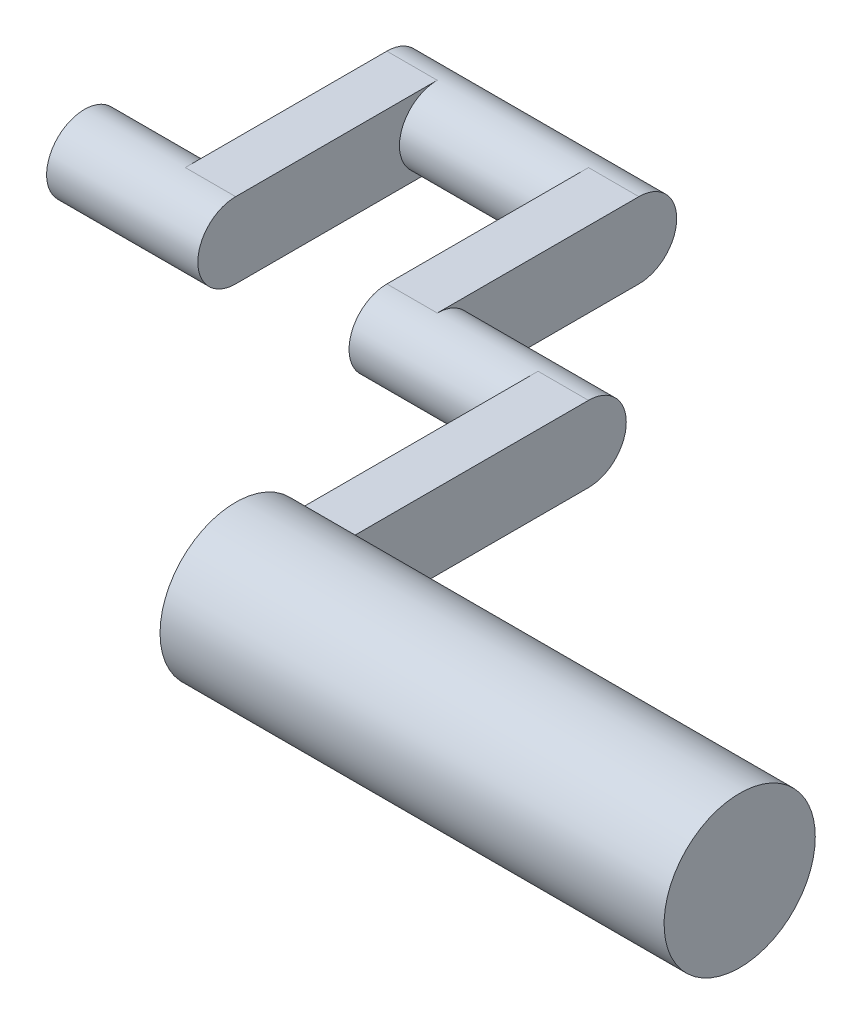
ISO-10303-21;
HEADER;
FILE_DESCRIPTION(('STEP AP214'),'2;1');
FILE_NAME('part.step','',(''),(''),'','','');
FILE_SCHEMA(('AUTOMOTIVE_DESIGN { 1 0 10303 214 1 1 1 1 }'));
ENDSEC;
DATA;
#1=APPLICATION_CONTEXT('core data for automotive mechanical design processes');
#2=APPLICATION_PROTOCOL_DEFINITION('international standard','automotive_design',2000,#1);
#3=PRODUCT_CONTEXT('',#1,'mechanical');
#4=PRODUCT('Part','Part','',(#3));
#5=PRODUCT_RELATED_PRODUCT_CATEGORY('part','',(#4));
#6=PRODUCT_DEFINITION_FORMATION('','',#4);
#7=PRODUCT_DEFINITION_CONTEXT('part definition',#1,'design');
#8=PRODUCT_DEFINITION('design','',#6,#7);
#9=PRODUCT_DEFINITION_SHAPE('','',#8);
#10=(LENGTH_UNIT() NAMED_UNIT(*) SI_UNIT(.MILLI.,.METRE.));
#11=(NAMED_UNIT(*) PLANE_ANGLE_UNIT() SI_UNIT($,.RADIAN.));
#12=(NAMED_UNIT(*) SI_UNIT($,.STERADIAN.) SOLID_ANGLE_UNIT());
#13=UNCERTAINTY_MEASURE_WITH_UNIT(LENGTH_MEASURE(1.E-05),#10,'distance_accuracy_value','');
#14=(GEOMETRIC_REPRESENTATION_CONTEXT(3) GLOBAL_UNCERTAINTY_ASSIGNED_CONTEXT((#13)) GLOBAL_UNIT_ASSIGNED_CONTEXT((#10,
#11,#12)) REPRESENTATION_CONTEXT('',''));
#15=CARTESIAN_POINT('',(0.,0.,0.));
#16=DIRECTION('',(0.,0.,1.));
#17=DIRECTION('',(1.,0.,0.));
#18=AXIS2_PLACEMENT_3D('',#15,#16,#17);
#19=CARTESIAN_POINT('',(-38.1,0.,-76.2));
#20=DIRECTION('',(1.,0.,0.));
#21=DIRECTION('',(0.,0.,-1.));
#22=AXIS2_PLACEMENT_3D('',#19,#20,#21);
#23=CYLINDRICAL_SURFACE('',#22,9.52500000000001);
#24=CARTESIAN_POINT('',(0.,0.,-76.2));
#25=DIRECTION('',(1.,0.,0.));
#26=DIRECTION('',(0.,0.,-1.));
#27=AXIS2_PLACEMENT_3D('',#24,#25,#26);
#28=CIRCLE('',#27,9.52500000000001);
#29=CARTESIAN_POINT('',(0.,9.52500000000001,-76.2));
#30=VERTEX_POINT('',#29);
#31=CARTESIAN_POINT('',(0.,-9.52499999999999,-76.2));
#32=VERTEX_POINT('',#31);
#33=EDGE_CURVE('E198',#30,#32,#28,.T.);
#34=ORIENTED_EDGE('',*,*,#33,.F.);
#35=DIRECTION('',(-1.,0.,0.));
#36=VECTOR('',#35,1.);
#37=CARTESIAN_POINT('',(12.7,9.52500000000001,-76.2));
#38=LINE('',#37,#36);
#39=CARTESIAN_POINT('',(12.7,9.52500000000001,-76.2));
#40=VERTEX_POINT('',#39);
#41=EDGE_CURVE('E223',#40,#30,#38,.T.);
#42=ORIENTED_EDGE('',*,*,#41,.F.);
#43=CARTESIAN_POINT('',(12.7,0.,-76.2));
#44=DIRECTION('',(1.,0.,0.));
#45=DIRECTION('',(0.,0.,-1.));
#46=AXIS2_PLACEMENT_3D('',#43,#44,#45);
#47=CIRCLE('',#46,9.52500000000001);
#48=CARTESIAN_POINT('',(12.7,-9.525,-76.2));
#49=VERTEX_POINT('',#48);
#50=EDGE_CURVE('E193',#49,#40,#47,.T.);
#51=ORIENTED_EDGE('',*,*,#50,.F.);
#52=DIRECTION('',(-1.,0.,0.));
#53=VECTOR('',#52,1.);
#54=CARTESIAN_POINT('',(12.7,-9.52499999999999,-76.2));
#55=LINE('',#54,#53);
#56=EDGE_CURVE('E208',#49,#32,#55,.T.);
#57=ORIENTED_EDGE('',*,*,#56,.T.);
#58=EDGE_LOOP('',(#34,#42,#51,#57));
#59=FACE_BOUND('',#58,.T.);
#60=CARTESIAN_POINT('',(-25.4,0.,-76.2));
#61=DIRECTION('',(1.,0.,0.));
#62=DIRECTION('',(0.,0.,-1.));
#63=AXIS2_PLACEMENT_3D('',#60,#61,#62);
#64=CIRCLE('',#63,9.52500000000001);
#65=CARTESIAN_POINT('',(-25.4,-9.525,-76.2));
#66=VERTEX_POINT('',#65);
#67=CARTESIAN_POINT('',(-25.4,9.52500000000001,-76.2));
#68=VERTEX_POINT('',#67);
#69=EDGE_CURVE('E170',#66,#68,#64,.T.);
#70=ORIENTED_EDGE('',*,*,#69,.T.);
#71=DIRECTION('',(-1.,0.,0.));
#72=VECTOR('',#71,1.);
#73=CARTESIAN_POINT('',(-25.4,9.52500000000001,-76.2));
#74=LINE('',#73,#72);
#75=CARTESIAN_POINT('',(-38.1,9.52500000000001,-76.2));
#76=VERTEX_POINT('',#75);
#77=EDGE_CURVE('E188',#68,#76,#74,.T.);
#78=ORIENTED_EDGE('',*,*,#77,.T.);
#79=CARTESIAN_POINT('',(-38.1,0.,-76.2));
#80=DIRECTION('',(1.,0.,0.));
#81=DIRECTION('',(0.,0.,-1.));
#82=AXIS2_PLACEMENT_3D('',#79,#80,#81);
#83=CIRCLE('',#82,9.52500000000001);
#84=CARTESIAN_POINT('',(-38.1,-9.52499999999999,-76.2));
#85=VERTEX_POINT('',#84);
#86=EDGE_CURVE('E196',#76,#85,#83,.T.);
#87=ORIENTED_EDGE('',*,*,#86,.T.);
#88=DIRECTION('',(-1.,0.,0.));
#89=VECTOR('',#88,1.);
#90=CARTESIAN_POINT('',(-25.4,-9.52499999999999,-76.2));
#91=LINE('',#90,#89);
#92=EDGE_CURVE('E185',#66,#85,#91,.T.);
#93=ORIENTED_EDGE('',*,*,#92,.F.);
#94=EDGE_LOOP('',(#70,#78,#87,#93));
#95=FACE_BOUND('',#94,.T.);
#96=ADVANCED_FACE('F35',(#59,#95),#23,.T.);
#97=CARTESIAN_POINT('',(127.,0.,0.));
#98=DIRECTION('',(-1.,0.,0.));
#99=DIRECTION('',(0.,0.,1.));
#100=AXIS2_PLACEMENT_3D('',#97,#98,#99);
#101=CYLINDRICAL_SURFACE('',#100,19.05);
#102=CARTESIAN_POINT('',(127.,0.,0.));
#103=DIRECTION('',(1.,0.,0.));
#104=DIRECTION('',(0.,0.,-1.));
#105=AXIS2_PLACEMENT_3D('',#102,#103,#104);
#106=CIRCLE('',#105,19.05);
#107=CARTESIAN_POINT('',(127.,0.,-19.05));
#108=VERTEX_POINT('',#107);
#109=EDGE_CURVE('E11',#108,#108,#106,.T.);
#110=ORIENTED_EDGE('',*,*,#109,.F.);
#111=EDGE_LOOP('',(#110));
#112=FACE_BOUND('',#111,.T.);
#113=DIRECTION('',(-1.,0.,0.));
#114=VECTOR('',#113,1.);
#115=CARTESIAN_POINT('',(12.7,9.525,-16.4977839420936));
#116=LINE('',#115,#114);
#117=CARTESIAN_POINT('',(12.7,9.525,-16.4977839420936));
#118=VERTEX_POINT('',#117);
#119=CARTESIAN_POINT('',(0.,9.525,-16.4977839420936));
#120=VERTEX_POINT('',#119);
#121=EDGE_CURVE('E220',#118,#120,#116,.T.);
#122=ORIENTED_EDGE('',*,*,#121,.T.);
#123=CARTESIAN_POINT('',(0.,0.,0.));
#124=DIRECTION('',(1.,0.,0.));
#125=DIRECTION('',(0.,0.,-1.));
#126=AXIS2_PLACEMENT_3D('',#123,#124,#125);
#127=CIRCLE('',#126,19.05);
#128=CARTESIAN_POINT('',(0.,-9.525,-16.4977839420936));
#129=VERTEX_POINT('',#128);
#130=EDGE_CURVE('E39',#120,#129,#127,.T.);
#131=ORIENTED_EDGE('',*,*,#130,.T.);
#132=DIRECTION('',(-1.,0.,0.));
#133=VECTOR('',#132,1.);
#134=CARTESIAN_POINT('',(12.7,-9.525,-16.4977839420936));
#135=LINE('',#134,#133);
#136=CARTESIAN_POINT('',(12.7,-9.525,-16.4977839420936));
#137=VERTEX_POINT('',#136);
#138=EDGE_CURVE('E217',#137,#129,#135,.T.);
#139=ORIENTED_EDGE('',*,*,#138,.F.);
#140=CARTESIAN_POINT('',(12.7,0.,0.));
#141=DIRECTION('',(1.,0.,0.));
#142=DIRECTION('',(0.,0.,-1.));
#143=AXIS2_PLACEMENT_3D('',#140,#141,#142);
#144=CIRCLE('',#143,19.05);
#145=EDGE_CURVE('E202',#137,#118,#144,.T.);
#146=ORIENTED_EDGE('',*,*,#145,.T.);
#147=EDGE_LOOP('',(#122,#131,#139,#146));
#148=FACE_BOUND('',#147,.T.);
#149=ADVANCED_FACE('F37',(#112,#148),#101,.T.);
#150=CARTESIAN_POINT('',(127.,0.,0.));
#151=DIRECTION('',(1.,0.,0.));
#152=DIRECTION('',(0.,0.,-1.));
#153=AXIS2_PLACEMENT_3D('',#150,#151,#152);
#154=PLANE('',#153);
#155=ORIENTED_EDGE('',*,*,#109,.T.);
#156=EDGE_LOOP('',(#155));
#157=FACE_BOUND('',#156,.T.);
#158=ADVANCED_FACE('F250',(#157),#154,.T.);
#159=CARTESIAN_POINT('',(0.,0.,0.));
#160=DIRECTION('',(1.,0.,0.));
#161=DIRECTION('',(0.,0.,-1.));
#162=AXIS2_PLACEMENT_3D('',#159,#160,#161);
#163=PLANE('',#162);
#164=ORIENTED_EDGE('',*,*,#130,.F.);
#165=DIRECTION('',(0.,0.,1.));
#166=VECTOR('',#165,1.);
#167=CARTESIAN_POINT('',(0.,9.525,0.));
#168=LINE('',#167,#166);
#169=EDGE_CURVE('E210',#30,#120,#168,.T.);
#170=ORIENTED_EDGE('',*,*,#169,.F.);
#171=ORIENTED_EDGE('',*,*,#33,.T.);
#172=DIRECTION('',(0.,0.,1.));
#173=VECTOR('',#172,1.);
#174=CARTESIAN_POINT('',(0.,-9.525,0.));
#175=LINE('',#174,#173);
#176=EDGE_CURVE('E203',#32,#129,#175,.T.);
#177=ORIENTED_EDGE('',*,*,#176,.T.);
#178=EDGE_LOOP('',(#164,#170,#171,#177));
#179=FACE_BOUND('',#178,.T.);
#180=ADVANCED_FACE('F235',(#179),#163,.F.);
#181=CARTESIAN_POINT('',(12.7,9.525,0.));
#182=DIRECTION('',(0.,-1.,0.));
#183=DIRECTION('',(0.,0.,-1.));
#184=AXIS2_PLACEMENT_3D('',#181,#182,#183);
#185=PLANE('',#184);
#186=ORIENTED_EDGE('',*,*,#169,.T.);
#187=ORIENTED_EDGE('',*,*,#121,.F.);
#188=DIRECTION('',(0.,0.,1.));
#189=VECTOR('',#188,1.);
#190=CARTESIAN_POINT('',(12.7,9.525,0.));
#191=LINE('',#190,#189);
#192=EDGE_CURVE('E199',#40,#118,#191,.T.);
#193=ORIENTED_EDGE('',*,*,#192,.F.);
#194=ORIENTED_EDGE('',*,*,#41,.T.);
#195=EDGE_LOOP('',(#186,#187,#193,#194));
#196=FACE_BOUND('',#195,.T.);
#197=ADVANCED_FACE('F242',(#196),#185,.F.);
#198=CARTESIAN_POINT('',(12.7,-9.525,0.));
#199=DIRECTION('',(0.,-1.,0.));
#200=DIRECTION('',(0.,0.,-1.));
#201=AXIS2_PLACEMENT_3D('',#198,#199,#200);
#202=PLANE('',#201);
#203=ORIENTED_EDGE('',*,*,#176,.F.);
#204=ORIENTED_EDGE('',*,*,#56,.F.);
#205=DIRECTION('',(0.,0.,1.));
#206=VECTOR('',#205,1.);
#207=CARTESIAN_POINT('',(12.7,-9.525,0.));
#208=LINE('',#207,#206);
#209=EDGE_CURVE('E205',#49,#137,#208,.T.);
#210=ORIENTED_EDGE('',*,*,#209,.T.);
#211=ORIENTED_EDGE('',*,*,#138,.T.);
#212=EDGE_LOOP('',(#203,#204,#210,#211));
#213=FACE_BOUND('',#212,.T.);
#214=ADVANCED_FACE('F233',(#213),#202,.T.);
#215=CARTESIAN_POINT('',(12.7,0.,0.));
#216=DIRECTION('',(1.,0.,0.));
#217=DIRECTION('',(0.,0.,-1.));
#218=AXIS2_PLACEMENT_3D('',#215,#216,#217);
#219=PLANE('',#218);
#220=ORIENTED_EDGE('',*,*,#209,.F.);
#221=ORIENTED_EDGE('',*,*,#50,.T.);
#222=ORIENTED_EDGE('',*,*,#192,.T.);
#223=ORIENTED_EDGE('',*,*,#145,.F.);
#224=EDGE_LOOP('',(#220,#221,#222,#223));
#225=FACE_BOUND('',#224,.T.);
#226=ADVANCED_FACE('F241',(#225),#219,.T.);
#227=CARTESIAN_POINT('',(-38.1,0.,0.));
#228=DIRECTION('',(1.,0.,0.));
#229=DIRECTION('',(0.,0.,-1.));
#230=AXIS2_PLACEMENT_3D('',#227,#228,#229);
#231=PLANE('',#230);
#232=ORIENTED_EDGE('',*,*,#86,.F.);
#233=DIRECTION('',(0.,0.,1.));
#234=VECTOR('',#233,1.);
#235=CARTESIAN_POINT('',(-38.1,9.525,0.));
#236=LINE('',#235,#234);
#237=CARTESIAN_POINT('',(-38.1,9.52500000000001,-127.));
#238=VERTEX_POINT('',#237);
#239=EDGE_CURVE('E178',#238,#76,#236,.T.);
#240=ORIENTED_EDGE('',*,*,#239,.F.);
#241=CARTESIAN_POINT('',(-38.1,0.,-127.));
#242=DIRECTION('',(1.,0.,0.));
#243=DIRECTION('',(0.,0.,-1.));
#244=AXIS2_PLACEMENT_3D('',#241,#242,#243);
#245=CIRCLE('',#244,9.525);
#246=CARTESIAN_POINT('',(-38.1,-9.52499999999999,-127.));
#247=VERTEX_POINT('',#246);
#248=EDGE_CURVE('E164',#238,#247,#245,.T.);
#249=ORIENTED_EDGE('',*,*,#248,.T.);
#250=DIRECTION('',(0.,0.,1.));
#251=VECTOR('',#250,1.);
#252=CARTESIAN_POINT('',(-38.1,-9.525,0.));
#253=LINE('',#252,#251);
#254=EDGE_CURVE('E171',#247,#85,#253,.T.);
#255=ORIENTED_EDGE('',*,*,#254,.T.);
#256=EDGE_LOOP('',(#232,#240,#249,#255));
#257=FACE_BOUND('',#256,.T.);
#258=ADVANCED_FACE('F260',(#257),#231,.F.);
#259=CARTESIAN_POINT('',(-25.4,9.525,0.));
#260=DIRECTION('',(0.,-1.,0.));
#261=DIRECTION('',(0.,0.,-1.));
#262=AXIS2_PLACEMENT_3D('',#259,#260,#261);
#263=PLANE('',#262);
#264=ORIENTED_EDGE('',*,*,#239,.T.);
#265=ORIENTED_EDGE('',*,*,#77,.F.);
#266=DIRECTION('',(0.,0.,1.));
#267=VECTOR('',#266,1.);
#268=CARTESIAN_POINT('',(-25.4,9.525,0.));
#269=LINE('',#268,#267);
#270=CARTESIAN_POINT('',(-25.4,9.52500000000001,-127.));
#271=VERTEX_POINT('',#270);
#272=EDGE_CURVE('E167',#271,#68,#269,.T.);
#273=ORIENTED_EDGE('',*,*,#272,.F.);
#274=DIRECTION('',(-1.,0.,0.));
#275=VECTOR('',#274,1.);
#276=CARTESIAN_POINT('',(-25.4,9.52500000000001,-127.));
#277=LINE('',#276,#275);
#278=EDGE_CURVE('E191',#271,#238,#277,.T.);
#279=ORIENTED_EDGE('',*,*,#278,.T.);
#280=EDGE_LOOP('',(#264,#265,#273,#279));
#281=FACE_BOUND('',#280,.T.);
#282=ADVANCED_FACE('F266',(#281),#263,.F.);
#283=CARTESIAN_POINT('',(-25.4,-9.525,0.));
#284=DIRECTION('',(0.,-1.,0.));
#285=DIRECTION('',(0.,0.,-1.));
#286=AXIS2_PLACEMENT_3D('',#283,#284,#285);
#287=PLANE('',#286);
#288=ORIENTED_EDGE('',*,*,#254,.F.);
#289=DIRECTION('',(-1.,0.,0.));
#290=VECTOR('',#289,1.);
#291=CARTESIAN_POINT('',(-25.4,-9.52499999999999,-127.));
#292=LINE('',#291,#290);
#293=CARTESIAN_POINT('',(-25.4,-9.52499999999998,-127.));
#294=VERTEX_POINT('',#293);
#295=EDGE_CURVE('E176',#294,#247,#292,.T.);
#296=ORIENTED_EDGE('',*,*,#295,.F.);
#297=DIRECTION('',(0.,0.,1.));
#298=VECTOR('',#297,1.);
#299=CARTESIAN_POINT('',(-25.4,-9.525,0.));
#300=LINE('',#299,#298);
#301=EDGE_CURVE('E173',#294,#66,#300,.T.);
#302=ORIENTED_EDGE('',*,*,#301,.T.);
#303=ORIENTED_EDGE('',*,*,#92,.T.);
#304=EDGE_LOOP('',(#288,#296,#302,#303));
#305=FACE_BOUND('',#304,.T.);
#306=ADVANCED_FACE('F271',(#305),#287,.T.);
#307=CARTESIAN_POINT('',(-25.4,0.,0.));
#308=DIRECTION('',(1.,0.,0.));
#309=DIRECTION('',(0.,0.,-1.));
#310=AXIS2_PLACEMENT_3D('',#307,#308,#309);
#311=PLANE('',#310);
#312=ORIENTED_EDGE('',*,*,#301,.F.);
#313=CARTESIAN_POINT('',(-25.4,0.,-127.));
#314=DIRECTION('',(1.,0.,0.));
#315=DIRECTION('',(0.,0.,-1.));
#316=AXIS2_PLACEMENT_3D('',#313,#314,#315);
#317=CIRCLE('',#316,9.525);
#318=EDGE_CURVE('E161',#294,#271,#317,.T.);
#319=ORIENTED_EDGE('',*,*,#318,.T.);
#320=ORIENTED_EDGE('',*,*,#272,.T.);
#321=ORIENTED_EDGE('',*,*,#69,.F.);
#322=EDGE_LOOP('',(#312,#319,#320,#321));
#323=FACE_BOUND('',#322,.T.);
#324=ADVANCED_FACE('F283',(#323),#311,.T.);
#325=CARTESIAN_POINT('',(-88.9,0.,-127.));
#326=DIRECTION('',(1.,0.,0.));
#327=DIRECTION('',(0.,0.,-1.));
#328=AXIS2_PLACEMENT_3D('',#325,#326,#327);
#329=CYLINDRICAL_SURFACE('',#328,9.525);
#330=DIRECTION('',(-1.,0.,0.));
#331=VECTOR('',#330,1.);
#332=CARTESIAN_POINT('',(-76.2,9.52500000000001,-127.));
#333=LINE('',#332,#331);
#334=CARTESIAN_POINT('',(-76.2,9.52500000000001,-127.));
#335=VERTEX_POINT('',#334);
#336=CARTESIAN_POINT('',(-88.9,9.52500000000001,-127.));
#337=VERTEX_POINT('',#336);
#338=EDGE_CURVE('E50',#335,#337,#333,.T.);
#339=ORIENTED_EDGE('',*,*,#338,.F.);
#340=CARTESIAN_POINT('',(-76.2,0.,-127.));
#341=DIRECTION('',(1.,0.,0.));
#342=DIRECTION('',(0.,0.,-1.));
#343=AXIS2_PLACEMENT_3D('',#340,#341,#342);
#344=CIRCLE('',#343,9.525);
#345=CARTESIAN_POINT('',(-76.2,-9.52499999999998,-127.));
#346=VERTEX_POINT('',#345);
#347=EDGE_CURVE('E55',#335,#346,#344,.T.);
#348=ORIENTED_EDGE('',*,*,#347,.T.);
#349=DIRECTION('',(-1.,0.,0.));
#350=VECTOR('',#349,1.);
#351=CARTESIAN_POINT('',(-76.2,-9.52499999999999,-127.));
#352=LINE('',#351,#350);
#353=CARTESIAN_POINT('',(-88.9,-9.52499999999999,-127.));
#354=VERTEX_POINT('',#353);
#355=EDGE_CURVE('E152',#346,#354,#352,.T.);
#356=ORIENTED_EDGE('',*,*,#355,.T.);
#357=CARTESIAN_POINT('',(-88.9,0.,-127.));
#358=DIRECTION('',(1.,0.,0.));
#359=DIRECTION('',(0.,0.,-1.));
#360=AXIS2_PLACEMENT_3D('',#357,#358,#359);
#361=CIRCLE('',#360,9.525);
#362=EDGE_CURVE('E162',#354,#337,#361,.T.);
#363=ORIENTED_EDGE('',*,*,#362,.T.);
#364=EDGE_LOOP('',(#339,#348,#356,#363));
#365=FACE_BOUND('',#364,.T.);
#366=ORIENTED_EDGE('',*,*,#248,.F.);
#367=ORIENTED_EDGE('',*,*,#278,.F.);
#368=ORIENTED_EDGE('',*,*,#318,.F.);
#369=ORIENTED_EDGE('',*,*,#295,.T.);
#370=EDGE_LOOP('',(#366,#367,#368,#369));
#371=FACE_BOUND('',#370,.T.);
#372=ADVANCED_FACE('F281',(#365,#371),#329,.T.);
#373=CARTESIAN_POINT('',(-88.9,0.,0.));
#374=DIRECTION('',(1.,0.,0.));
#375=DIRECTION('',(0.,0.,-1.));
#376=AXIS2_PLACEMENT_3D('',#373,#374,#375);
#377=PLANE('',#376);
#378=ORIENTED_EDGE('',*,*,#362,.F.);
#379=DIRECTION('',(0.,0.,1.));
#380=VECTOR('',#379,1.);
#381=CARTESIAN_POINT('',(-88.9,-9.525,0.));
#382=LINE('',#381,#380);
#383=CARTESIAN_POINT('',(-88.9,-9.52499999999999,-76.2));
#384=VERTEX_POINT('',#383);
#385=EDGE_CURVE('E149',#354,#384,#382,.T.);
#386=ORIENTED_EDGE('',*,*,#385,.T.);
#387=CARTESIAN_POINT('',(-88.9,0.,-76.2));
#388=DIRECTION('',(1.,0.,0.));
#389=DIRECTION('',(0.,0.,-1.));
#390=AXIS2_PLACEMENT_3D('',#387,#388,#389);
#391=CIRCLE('',#390,9.52500000000001);
#392=CARTESIAN_POINT('',(-88.9,9.52500000000001,-76.2));
#393=VERTEX_POINT('',#392);
#394=EDGE_CURVE('E154',#384,#393,#391,.T.);
#395=ORIENTED_EDGE('',*,*,#394,.T.);
#396=DIRECTION('',(0.,0.,1.));
#397=VECTOR('',#396,1.);
#398=CARTESIAN_POINT('',(-88.9,9.525,0.));
#399=LINE('',#398,#397);
#400=EDGE_CURVE('E128',#337,#393,#399,.T.);
#401=ORIENTED_EDGE('',*,*,#400,.F.);
#402=EDGE_LOOP('',(#378,#386,#395,#401));
#403=FACE_BOUND('',#402,.T.);
#404=ADVANCED_FACE('F295',(#403),#377,.F.);
#405=CARTESIAN_POINT('',(-76.2,9.525,0.));
#406=DIRECTION('',(0.,-1.,0.));
#407=DIRECTION('',(0.,0.,-1.));
#408=AXIS2_PLACEMENT_3D('',#405,#406,#407);
#409=PLANE('',#408);
#410=ORIENTED_EDGE('',*,*,#400,.T.);
#411=DIRECTION('',(-1.,0.,0.));
#412=VECTOR('',#411,1.);
#413=CARTESIAN_POINT('',(-76.2,9.52500000000001,-76.2));
#414=LINE('',#413,#412);
#415=CARTESIAN_POINT('',(-76.2,9.52500000000001,-76.2));
#416=VERTEX_POINT('',#415);
#417=EDGE_CURVE('E123',#416,#393,#414,.T.);
#418=ORIENTED_EDGE('',*,*,#417,.F.);
#419=DIRECTION('',(0.,0.,1.));
#420=VECTOR('',#419,1.);
#421=CARTESIAN_POINT('',(-76.2,9.525,0.));
#422=LINE('',#421,#420);
#423=EDGE_CURVE('E126',#335,#416,#422,.T.);
#424=ORIENTED_EDGE('',*,*,#423,.F.);
#425=ORIENTED_EDGE('',*,*,#338,.T.);
#426=EDGE_LOOP('',(#410,#418,#424,#425));
#427=FACE_BOUND('',#426,.T.);
#428=ADVANCED_FACE('F125',(#427),#409,.F.);
#429=CARTESIAN_POINT('',(-76.2,-9.525,0.));
#430=DIRECTION('',(0.,-1.,0.));
#431=DIRECTION('',(0.,0.,-1.));
#432=AXIS2_PLACEMENT_3D('',#429,#430,#431);
#433=PLANE('',#432);
#434=ORIENTED_EDGE('',*,*,#385,.F.);
#435=ORIENTED_EDGE('',*,*,#355,.F.);
#436=DIRECTION('',(0.,0.,1.));
#437=VECTOR('',#436,1.);
#438=CARTESIAN_POINT('',(-76.2,-9.525,0.));
#439=LINE('',#438,#437);
#440=CARTESIAN_POINT('',(-76.2,-9.52499999999999,-76.2));
#441=VERTEX_POINT('',#440);
#442=EDGE_CURVE('E140',#346,#441,#439,.T.);
#443=ORIENTED_EDGE('',*,*,#442,.T.);
#444=DIRECTION('',(-1.,0.,0.));
#445=VECTOR('',#444,1.);
#446=CARTESIAN_POINT('',(-76.2,-9.52499999999999,-76.2));
#447=LINE('',#446,#445);
#448=EDGE_CURVE('E133',#441,#384,#447,.T.);
#449=ORIENTED_EDGE('',*,*,#448,.T.);
#450=EDGE_LOOP('',(#434,#435,#443,#449));
#451=FACE_BOUND('',#450,.T.);
#452=ADVANCED_FACE('F301',(#451),#433,.T.);
#453=CARTESIAN_POINT('',(-76.2,0.,0.));
#454=DIRECTION('',(1.,0.,0.));
#455=DIRECTION('',(0.,0.,-1.));
#456=AXIS2_PLACEMENT_3D('',#453,#454,#455);
#457=PLANE('',#456);
#458=ORIENTED_EDGE('',*,*,#347,.F.);
#459=ORIENTED_EDGE('',*,*,#423,.T.);
#460=CARTESIAN_POINT('',(-76.2,0.,-76.2));
#461=DIRECTION('',(1.,0.,0.));
#462=DIRECTION('',(0.,0.,-1.));
#463=AXIS2_PLACEMENT_3D('',#460,#461,#462);
#464=CIRCLE('',#463,9.52500000000001);
#465=EDGE_CURVE('E139',#416,#441,#464,.T.);
#466=ORIENTED_EDGE('',*,*,#465,.T.);
#467=ORIENTED_EDGE('',*,*,#442,.F.);
#468=EDGE_LOOP('',(#458,#459,#466,#467));
#469=FACE_BOUND('',#468,.T.);
#470=ADVANCED_FACE('F137',(#469),#457,.T.);
#471=CARTESIAN_POINT('',(-114.3,0.,-76.2));
#472=DIRECTION('',(1.,0.,0.));
#473=DIRECTION('',(0.,0.,-1.));
#474=AXIS2_PLACEMENT_3D('',#471,#472,#473);
#475=CYLINDRICAL_SURFACE('',#474,9.52500000000001);
#476=CARTESIAN_POINT('',(-114.3,0.,-76.2));
#477=DIRECTION('',(1.,0.,0.));
#478=DIRECTION('',(0.,0.,-1.));
#479=AXIS2_PLACEMENT_3D('',#476,#477,#478);
#480=CIRCLE('',#479,9.52500000000001);
#481=CARTESIAN_POINT('',(-114.3,0.,-85.725));
#482=VERTEX_POINT('',#481);
#483=EDGE_CURVE('E144',#482,#482,#480,.T.);
#484=ORIENTED_EDGE('',*,*,#483,.T.);
#485=EDGE_LOOP('',(#484));
#486=FACE_BOUND('',#485,.T.);
#487=ORIENTED_EDGE('',*,*,#417,.T.);
#488=ORIENTED_EDGE('',*,*,#394,.F.);
#489=ORIENTED_EDGE('',*,*,#448,.F.);
#490=ORIENTED_EDGE('',*,*,#465,.F.);
#491=EDGE_LOOP('',(#487,#488,#489,#490));
#492=FACE_BOUND('',#491,.T.);
#493=ADVANCED_FACE('F143',(#486,#492),#475,.T.);
#494=CARTESIAN_POINT('',(-114.3,0.,-76.2));
#495=DIRECTION('',(1.,0.,0.));
#496=DIRECTION('',(0.,0.,-1.));
#497=AXIS2_PLACEMENT_3D('',#494,#495,#496);
#498=PLANE('',#497);
#499=ORIENTED_EDGE('',*,*,#483,.F.);
#500=EDGE_LOOP('',(#499));
#501=FACE_BOUND('',#500,.T.);
#502=ADVANCED_FACE('F309',(#501),#498,.F.);
#503=CLOSED_SHELL('',(#96,#149,#158,#180,#197,#214,#226,#258,#282,#306,#324,#372,#404,#428,#452,
#470,#493,#502));
#504=MANIFOLD_SOLID_BREP('B2',#503);
#505=ADVANCED_BREP_SHAPE_REPRESENTATION('',(#18,#504),#14);
#506=SHAPE_DEFINITION_REPRESENTATION(#9,#505);
ENDSEC;
END-ISO-10303-21;
